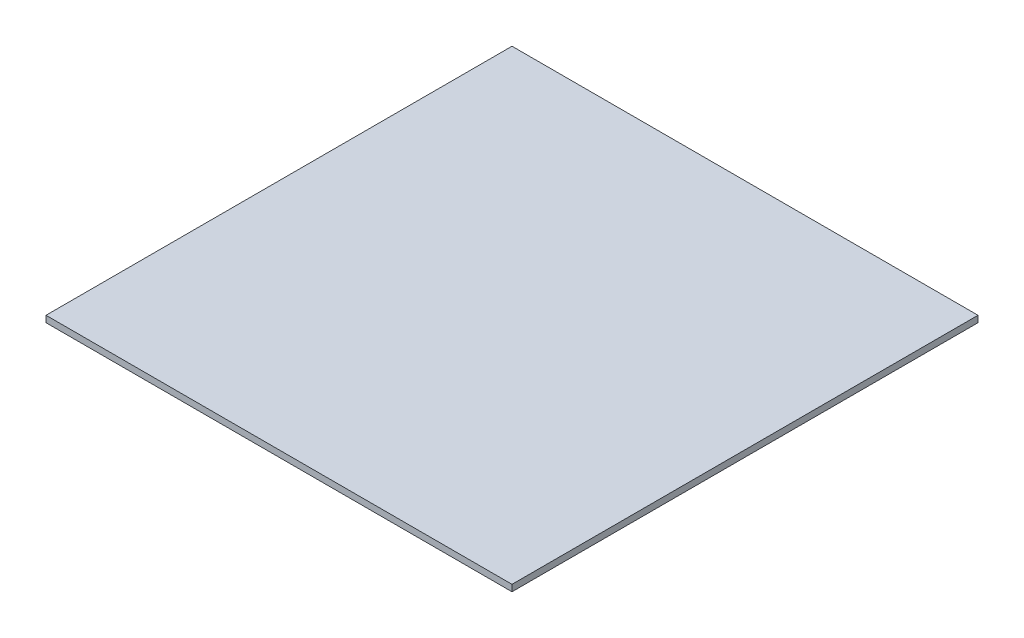
ISO-10303-21;
HEADER;
FILE_DESCRIPTION(('STEP AP214'),'2;1');
FILE_NAME('part.step','',(''),(''),'','','');
FILE_SCHEMA(('AUTOMOTIVE_DESIGN { 1 0 10303 214 1 1 1 1 }'));
ENDSEC;
DATA;
#1=APPLICATION_CONTEXT('core data for automotive mechanical design processes');
#2=APPLICATION_PROTOCOL_DEFINITION('international standard','automotive_design',2000,#1);
#3=PRODUCT_CONTEXT('',#1,'mechanical');
#4=PRODUCT('Part','Part','',(#3));
#5=PRODUCT_RELATED_PRODUCT_CATEGORY('part','',(#4));
#6=PRODUCT_DEFINITION_FORMATION('','',#4);
#7=PRODUCT_DEFINITION_CONTEXT('part definition',#1,'design');
#8=PRODUCT_DEFINITION('design','',#6,#7);
#9=PRODUCT_DEFINITION_SHAPE('','',#8);
#10=(LENGTH_UNIT() NAMED_UNIT(*) SI_UNIT(.MILLI.,.METRE.));
#11=(NAMED_UNIT(*) PLANE_ANGLE_UNIT() SI_UNIT($,.RADIAN.));
#12=(NAMED_UNIT(*) SI_UNIT($,.STERADIAN.) SOLID_ANGLE_UNIT());
#13=UNCERTAINTY_MEASURE_WITH_UNIT(LENGTH_MEASURE(1.E-05),#10,'distance_accuracy_value','');
#14=(GEOMETRIC_REPRESENTATION_CONTEXT(3) GLOBAL_UNCERTAINTY_ASSIGNED_CONTEXT((#13)) GLOBAL_UNIT_ASSIGNED_CONTEXT((#10,
#11,#12)) REPRESENTATION_CONTEXT('',''));
#15=CARTESIAN_POINT('',(0.,0.,0.));
#16=DIRECTION('',(0.,0.,1.));
#17=DIRECTION('',(1.,0.,0.));
#18=AXIS2_PLACEMENT_3D('',#15,#16,#17);
#19=CARTESIAN_POINT('',(0.,12.7,0.));
#20=DIRECTION('',(1.,0.,0.));
#21=DIRECTION('',(0.,0.,-1.));
#22=AXIS2_PLACEMENT_3D('',#19,#20,#21);
#23=PLANE('',#22);
#24=DIRECTION('',(0.,0.,1.));
#25=VECTOR('',#24,1.);
#26=CARTESIAN_POINT('',(0.,0.,0.));
#27=LINE('',#26,#25);
#28=CARTESIAN_POINT('',(0.,0.,-914.4));
#29=VERTEX_POINT('',#28);
#30=CARTESIAN_POINT('',(0.,0.,0.));
#31=VERTEX_POINT('',#30);
#32=EDGE_CURVE('E100',#29,#31,#27,.T.);
#33=ORIENTED_EDGE('',*,*,#32,.T.);
#34=DIRECTION('',(0.,-1.,0.));
#35=VECTOR('',#34,1.);
#36=CARTESIAN_POINT('',(0.,12.7,0.));
#37=LINE('',#36,#35);
#38=CARTESIAN_POINT('',(0.,12.7,0.));
#39=VERTEX_POINT('',#38);
#40=EDGE_CURVE('E11',#39,#31,#37,.T.);
#41=ORIENTED_EDGE('',*,*,#40,.F.);
#42=DIRECTION('',(0.,0.,1.));
#43=VECTOR('',#42,1.);
#44=CARTESIAN_POINT('',(0.,12.7,0.));
#45=LINE('',#44,#43);
#46=CARTESIAN_POINT('',(0.,12.7,-914.4));
#47=VERTEX_POINT('',#46);
#48=EDGE_CURVE('E88',#47,#39,#45,.T.);
#49=ORIENTED_EDGE('',*,*,#48,.F.);
#50=DIRECTION('',(0.,-1.,0.));
#51=VECTOR('',#50,1.);
#52=CARTESIAN_POINT('',(0.,12.7,-914.4));
#53=LINE('',#52,#51);
#54=EDGE_CURVE('E96',#47,#29,#53,.T.);
#55=ORIENTED_EDGE('',*,*,#54,.T.);
#56=EDGE_LOOP('',(#33,#41,#49,#55));
#57=FACE_BOUND('',#56,.T.);
#58=ADVANCED_FACE('F37',(#57),#23,.F.);
#59=CARTESIAN_POINT('',(0.,12.7,0.));
#60=DIRECTION('',(0.,0.,-1.));
#61=DIRECTION('',(-1.,0.,0.));
#62=AXIS2_PLACEMENT_3D('',#59,#60,#61);
#63=PLANE('',#62);
#64=DIRECTION('',(1.,0.,0.));
#65=VECTOR('',#64,1.);
#66=CARTESIAN_POINT('',(0.,0.,0.));
#67=LINE('',#66,#65);
#68=CARTESIAN_POINT('',(914.4,0.,0.));
#69=VERTEX_POINT('',#68);
#70=EDGE_CURVE('E92',#31,#69,#67,.T.);
#71=ORIENTED_EDGE('',*,*,#70,.T.);
#72=DIRECTION('',(0.,-1.,0.));
#73=VECTOR('',#72,1.);
#74=CARTESIAN_POINT('',(914.4,12.7,0.));
#75=LINE('',#74,#73);
#76=CARTESIAN_POINT('',(914.4,12.7,0.));
#77=VERTEX_POINT('',#76);
#78=EDGE_CURVE('E45',#77,#69,#75,.T.);
#79=ORIENTED_EDGE('',*,*,#78,.F.);
#80=DIRECTION('',(1.,0.,0.));
#81=VECTOR('',#80,1.);
#82=CARTESIAN_POINT('',(0.,12.7,0.));
#83=LINE('',#82,#81);
#84=EDGE_CURVE('E83',#39,#77,#83,.T.);
#85=ORIENTED_EDGE('',*,*,#84,.F.);
#86=ORIENTED_EDGE('',*,*,#40,.T.);
#87=EDGE_LOOP('',(#71,#79,#85,#86));
#88=FACE_BOUND('',#87,.T.);
#89=ADVANCED_FACE('F91',(#88),#63,.F.);
#90=CARTESIAN_POINT('',(914.4,12.7,0.));
#91=DIRECTION('',(-1.,0.,0.));
#92=DIRECTION('',(0.,0.,1.));
#93=AXIS2_PLACEMENT_3D('',#90,#91,#92);
#94=PLANE('',#93);
#95=DIRECTION('',(0.,0.,-1.));
#96=VECTOR('',#95,1.);
#97=CARTESIAN_POINT('',(914.4,0.,0.));
#98=LINE('',#97,#96);
#99=CARTESIAN_POINT('',(914.4,0.,-914.4));
#100=VERTEX_POINT('',#99);
#101=EDGE_CURVE('E70',#69,#100,#98,.T.);
#102=ORIENTED_EDGE('',*,*,#101,.T.);
#103=DIRECTION('',(0.,-1.,0.));
#104=VECTOR('',#103,1.);
#105=CARTESIAN_POINT('',(914.4,12.7,-914.4));
#106=LINE('',#105,#104);
#107=CARTESIAN_POINT('',(914.4,12.7,-914.4));
#108=VERTEX_POINT('',#107);
#109=EDGE_CURVE('E93',#108,#100,#106,.T.);
#110=ORIENTED_EDGE('',*,*,#109,.F.);
#111=DIRECTION('',(0.,0.,-1.));
#112=VECTOR('',#111,1.);
#113=CARTESIAN_POINT('',(914.4,12.7,0.));
#114=LINE('',#113,#112);
#115=EDGE_CURVE('E86',#77,#108,#114,.T.);
#116=ORIENTED_EDGE('',*,*,#115,.F.);
#117=ORIENTED_EDGE('',*,*,#78,.T.);
#118=EDGE_LOOP('',(#102,#110,#116,#117));
#119=FACE_BOUND('',#118,.T.);
#120=ADVANCED_FACE('F94',(#119),#94,.F.);
#121=CARTESIAN_POINT('',(0.,12.7,-914.4));
#122=DIRECTION('',(0.,0.,1.));
#123=DIRECTION('',(1.,0.,0.));
#124=AXIS2_PLACEMENT_3D('',#121,#122,#123);
#125=PLANE('',#124);
#126=DIRECTION('',(-1.,0.,0.));
#127=VECTOR('',#126,1.);
#128=CARTESIAN_POINT('',(0.,0.,-914.4));
#129=LINE('',#128,#127);
#130=EDGE_CURVE('E76',#100,#29,#129,.T.);
#131=ORIENTED_EDGE('',*,*,#130,.T.);
#132=ORIENTED_EDGE('',*,*,#54,.F.);
#133=DIRECTION('',(-1.,0.,0.));
#134=VECTOR('',#133,1.);
#135=CARTESIAN_POINT('',(0.,12.7,-914.4));
#136=LINE('',#135,#134);
#137=EDGE_CURVE('E53',#108,#47,#136,.T.);
#138=ORIENTED_EDGE('',*,*,#137,.F.);
#139=ORIENTED_EDGE('',*,*,#109,.T.);
#140=EDGE_LOOP('',(#131,#132,#138,#139));
#141=FACE_BOUND('',#140,.T.);
#142=ADVANCED_FACE('F107',(#141),#125,.F.);
#143=CARTESIAN_POINT('',(0.,12.7,0.));
#144=DIRECTION('',(0.,-1.,0.));
#145=DIRECTION('',(0.,0.,-1.));
#146=AXIS2_PLACEMENT_3D('',#143,#144,#145);
#147=PLANE('',#146);
#148=ORIENTED_EDGE('',*,*,#48,.T.);
#149=ORIENTED_EDGE('',*,*,#84,.T.);
#150=ORIENTED_EDGE('',*,*,#115,.T.);
#151=ORIENTED_EDGE('',*,*,#137,.T.);
#152=EDGE_LOOP('',(#148,#149,#150,#151));
#153=FACE_BOUND('',#152,.T.);
#154=ADVANCED_FACE('F84',(#153),#147,.F.);
#155=CARTESIAN_POINT('',(0.,0.,0.));
#156=DIRECTION('',(0.,-1.,0.));
#157=DIRECTION('',(0.,0.,-1.));
#158=AXIS2_PLACEMENT_3D('',#155,#156,#157);
#159=PLANE('',#158);
#160=ORIENTED_EDGE('',*,*,#32,.F.);
#161=ORIENTED_EDGE('',*,*,#130,.F.);
#162=ORIENTED_EDGE('',*,*,#101,.F.);
#163=ORIENTED_EDGE('',*,*,#70,.F.);
#164=EDGE_LOOP('',(#160,#161,#162,#163));
#165=FACE_BOUND('',#164,.T.);
#166=ADVANCED_FACE('F110',(#165),#159,.T.);
#167=CLOSED_SHELL('',(#58,#89,#120,#142,#154,#166));
#168=MANIFOLD_SOLID_BREP('B2',#167);
#169=ADVANCED_BREP_SHAPE_REPRESENTATION('',(#18,#168),#14);
#170=SHAPE_DEFINITION_REPRESENTATION(#9,#169);
ENDSEC;
END-ISO-10303-21;
